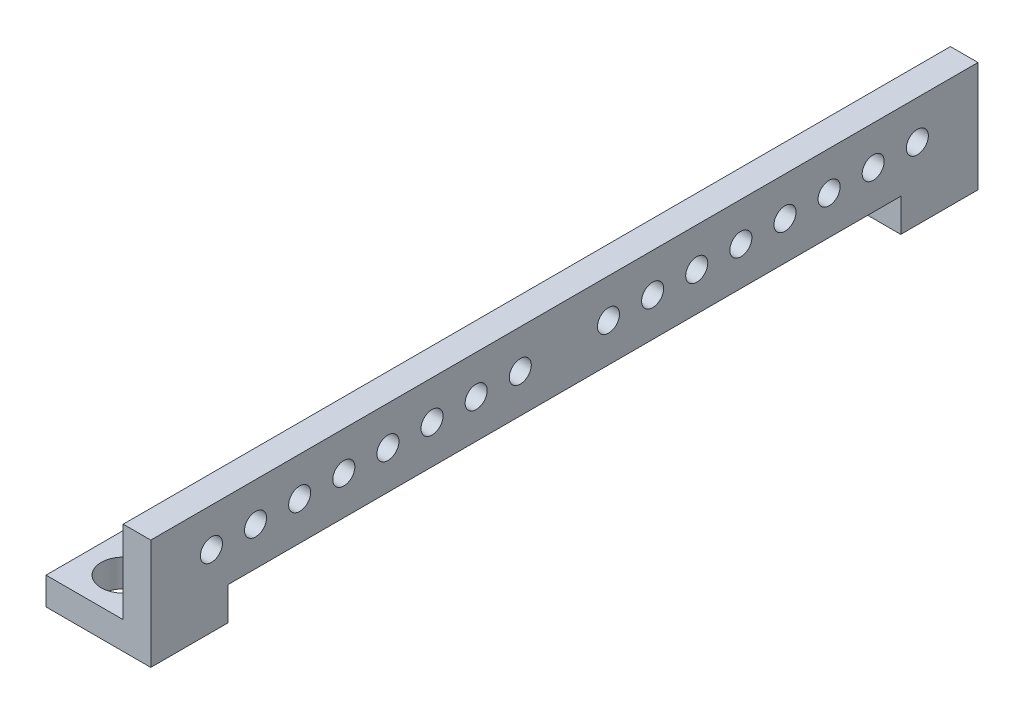
ISO-10303-21;
HEADER;
FILE_DESCRIPTION(('STEP AP214'),'2;1');
FILE_NAME('part.step','',(''),(''),'','','');
FILE_SCHEMA(('AUTOMOTIVE_DESIGN { 1 0 10303 214 1 1 1 1 }'));
ENDSEC;
DATA;
#1=APPLICATION_CONTEXT('core data for automotive mechanical design processes');
#2=APPLICATION_PROTOCOL_DEFINITION('international standard','automotive_design',2000,#1);
#3=PRODUCT_CONTEXT('',#1,'mechanical');
#4=PRODUCT('Part','Part','',(#3));
#5=PRODUCT_RELATED_PRODUCT_CATEGORY('part','',(#4));
#6=PRODUCT_DEFINITION_FORMATION('','',#4);
#7=PRODUCT_DEFINITION_CONTEXT('part definition',#1,'design');
#8=PRODUCT_DEFINITION('design','',#6,#7);
#9=PRODUCT_DEFINITION_SHAPE('','',#8);
#10=(LENGTH_UNIT() NAMED_UNIT(*) SI_UNIT(.MILLI.,.METRE.));
#11=(NAMED_UNIT(*) PLANE_ANGLE_UNIT() SI_UNIT($,.RADIAN.));
#12=(NAMED_UNIT(*) SI_UNIT($,.STERADIAN.) SOLID_ANGLE_UNIT());
#13=UNCERTAINTY_MEASURE_WITH_UNIT(LENGTH_MEASURE(1.E-05),#10,'distance_accuracy_value','');
#14=(GEOMETRIC_REPRESENTATION_CONTEXT(3) GLOBAL_UNCERTAINTY_ASSIGNED_CONTEXT((#13)) GLOBAL_UNIT_ASSIGNED_CONTEXT((#10,
#11,#12)) REPRESENTATION_CONTEXT('',''));
#15=CARTESIAN_POINT('',(0.,0.,0.));
#16=DIRECTION('',(0.,0.,1.));
#17=DIRECTION('',(1.,0.,0.));
#18=AXIS2_PLACEMENT_3D('',#15,#16,#17);
#19=CARTESIAN_POINT('',(0.,0.,0.));
#20=DIRECTION('',(-1.,0.,0.));
#21=DIRECTION('',(0.,0.,1.));
#22=AXIS2_PLACEMENT_3D('',#19,#20,#21);
#23=PLANE('',#22);
#24=CARTESIAN_POINT('',(0.,13.,8.));
#25=DIRECTION('',(1.,0.,0.));
#26=DIRECTION('',(0.,0.,-1.));
#27=AXIS2_PLACEMENT_3D('',#24,#25,#26);
#28=CIRCLE('',#27,2.);
#29=CARTESIAN_POINT('',(0.,13.,6.));
#30=VERTEX_POINT('',#29);
#31=EDGE_CURVE('E208',#30,#30,#28,.T.);
#32=ORIENTED_EDGE('',*,*,#31,.T.);
#33=EDGE_LOOP('',(#32));
#34=FACE_BOUND('',#33,.T.);
#35=CARTESIAN_POINT('',(0.,13.,-56.));
#36=DIRECTION('',(1.,0.,0.));
#37=DIRECTION('',(0.,0.,-1.));
#38=AXIS2_PLACEMENT_3D('',#35,#36,#37);
#39=CIRCLE('',#38,2.);
#40=CARTESIAN_POINT('',(0.,13.,-58.));
#41=VERTEX_POINT('',#40);
#42=EDGE_CURVE('E224',#41,#41,#39,.T.);
#43=ORIENTED_EDGE('',*,*,#42,.T.);
#44=EDGE_LOOP('',(#43));
#45=FACE_BOUND('',#44,.T.);
#46=CARTESIAN_POINT('',(0.,13.,64.));
#47=DIRECTION('',(1.,0.,0.));
#48=DIRECTION('',(0.,0.,-1.));
#49=AXIS2_PLACEMENT_3D('',#46,#47,#48);
#50=CIRCLE('',#49,2.);
#51=CARTESIAN_POINT('',(0.,13.,62.));
#52=VERTEX_POINT('',#51);
#53=EDGE_CURVE('E240',#52,#52,#50,.T.);
#54=ORIENTED_EDGE('',*,*,#53,.T.);
#55=EDGE_LOOP('',(#54));
#56=FACE_BOUND('',#55,.T.);
#57=CARTESIAN_POINT('',(0.,13.,48.));
#58=DIRECTION('',(1.,0.,0.));
#59=DIRECTION('',(0.,0.,-1.));
#60=AXIS2_PLACEMENT_3D('',#57,#58,#59);
#61=CIRCLE('',#60,2.);
#62=CARTESIAN_POINT('',(0.,13.,46.));
#63=VERTEX_POINT('',#62);
#64=EDGE_CURVE('E256',#63,#63,#61,.T.);
#65=ORIENTED_EDGE('',*,*,#64,.T.);
#66=EDGE_LOOP('',(#65));
#67=FACE_BOUND('',#66,.T.);
#68=CARTESIAN_POINT('',(0.,13.,-32.));
#69=DIRECTION('',(1.,0.,0.));
#70=DIRECTION('',(0.,0.,-1.));
#71=AXIS2_PLACEMENT_3D('',#68,#69,#70);
#72=CIRCLE('',#71,2.);
#73=CARTESIAN_POINT('',(0.,13.,-34.));
#74=VERTEX_POINT('',#73);
#75=EDGE_CURVE('E272',#74,#74,#72,.T.);
#76=ORIENTED_EDGE('',*,*,#75,.T.);
#77=EDGE_LOOP('',(#76));
#78=FACE_BOUND('',#77,.T.);
#79=CARTESIAN_POINT('',(0.,13.,-16.));
#80=DIRECTION('',(1.,0.,0.));
#81=DIRECTION('',(0.,0.,-1.));
#82=AXIS2_PLACEMENT_3D('',#79,#80,#81);
#83=CIRCLE('',#82,2.);
#84=CARTESIAN_POINT('',(0.,13.,-18.));
#85=VERTEX_POINT('',#84);
#86=EDGE_CURVE('E288',#85,#85,#83,.T.);
#87=ORIENTED_EDGE('',*,*,#86,.T.);
#88=EDGE_LOOP('',(#87));
#89=FACE_BOUND('',#88,.T.);
#90=CARTESIAN_POINT('',(0.,13.,32.));
#91=DIRECTION('',(1.,0.,0.));
#92=DIRECTION('',(0.,0.,-1.));
#93=AXIS2_PLACEMENT_3D('',#90,#91,#92);
#94=CIRCLE('',#93,2.);
#95=CARTESIAN_POINT('',(0.,13.,30.));
#96=VERTEX_POINT('',#95);
#97=EDGE_CURVE('E304',#96,#96,#94,.T.);
#98=ORIENTED_EDGE('',*,*,#97,.T.);
#99=EDGE_LOOP('',(#98));
#100=FACE_BOUND('',#99,.T.);
#101=CARTESIAN_POINT('',(0.,13.,16.));
#102=DIRECTION('',(1.,0.,0.));
#103=DIRECTION('',(0.,0.,-1.));
#104=AXIS2_PLACEMENT_3D('',#101,#102,#103);
#105=CIRCLE('',#104,2.);
#106=CARTESIAN_POINT('',(0.,13.,14.));
#107=VERTEX_POINT('',#106);
#108=EDGE_CURVE('E320',#107,#107,#105,.T.);
#109=ORIENTED_EDGE('',*,*,#108,.T.);
#110=EDGE_LOOP('',(#109));
#111=FACE_BOUND('',#110,.T.);
#112=CARTESIAN_POINT('',(0.,13.,24.));
#113=DIRECTION('',(1.,0.,0.));
#114=DIRECTION('',(0.,0.,-1.));
#115=AXIS2_PLACEMENT_3D('',#112,#113,#114);
#116=CIRCLE('',#115,2.);
#117=CARTESIAN_POINT('',(0.,13.,22.));
#118=VERTEX_POINT('',#117);
#119=EDGE_CURVE('E312',#118,#118,#116,.T.);
#120=ORIENTED_EDGE('',*,*,#119,.T.);
#121=EDGE_LOOP('',(#120));
#122=FACE_BOUND('',#121,.T.);
#123=CARTESIAN_POINT('',(0.,13.,40.));
#124=DIRECTION('',(1.,0.,0.));
#125=DIRECTION('',(0.,0.,-1.));
#126=AXIS2_PLACEMENT_3D('',#123,#124,#125);
#127=CIRCLE('',#126,2.);
#128=CARTESIAN_POINT('',(0.,13.,38.));
#129=VERTEX_POINT('',#128);
#130=EDGE_CURVE('E296',#129,#129,#127,.T.);
#131=ORIENTED_EDGE('',*,*,#130,.T.);
#132=EDGE_LOOP('',(#131));
#133=FACE_BOUND('',#132,.T.);
#134=CARTESIAN_POINT('',(0.,13.,-24.));
#135=DIRECTION('',(1.,0.,0.));
#136=DIRECTION('',(0.,0.,-1.));
#137=AXIS2_PLACEMENT_3D('',#134,#135,#136);
#138=CIRCLE('',#137,2.);
#139=CARTESIAN_POINT('',(0.,13.,-26.));
#140=VERTEX_POINT('',#139);
#141=EDGE_CURVE('E280',#140,#140,#138,.T.);
#142=ORIENTED_EDGE('',*,*,#141,.T.);
#143=EDGE_LOOP('',(#142));
#144=FACE_BOUND('',#143,.T.);
#145=CARTESIAN_POINT('',(0.,13.,-40.));
#146=DIRECTION('',(1.,0.,0.));
#147=DIRECTION('',(0.,0.,-1.));
#148=AXIS2_PLACEMENT_3D('',#145,#146,#147);
#149=CIRCLE('',#148,2.);
#150=CARTESIAN_POINT('',(0.,13.,-42.));
#151=VERTEX_POINT('',#150);
#152=EDGE_CURVE('E264',#151,#151,#149,.T.);
#153=ORIENTED_EDGE('',*,*,#152,.T.);
#154=EDGE_LOOP('',(#153));
#155=FACE_BOUND('',#154,.T.);
#156=CARTESIAN_POINT('',(0.,13.,56.));
#157=DIRECTION('',(1.,0.,0.));
#158=DIRECTION('',(0.,0.,-1.));
#159=AXIS2_PLACEMENT_3D('',#156,#157,#158);
#160=CIRCLE('',#159,2.);
#161=CARTESIAN_POINT('',(0.,13.,54.));
#162=VERTEX_POINT('',#161);
#163=EDGE_CURVE('E248',#162,#162,#160,.T.);
#164=ORIENTED_EDGE('',*,*,#163,.T.);
#165=EDGE_LOOP('',(#164));
#166=FACE_BOUND('',#165,.T.);
#167=CARTESIAN_POINT('',(0.,13.,-48.));
#168=DIRECTION('',(1.,0.,0.));
#169=DIRECTION('',(0.,0.,-1.));
#170=AXIS2_PLACEMENT_3D('',#167,#168,#169);
#171=CIRCLE('',#170,2.);
#172=CARTESIAN_POINT('',(0.,13.,-50.));
#173=VERTEX_POINT('',#172);
#174=EDGE_CURVE('E232',#173,#173,#171,.T.);
#175=ORIENTED_EDGE('',*,*,#174,.T.);
#176=EDGE_LOOP('',(#175));
#177=FACE_BOUND('',#176,.T.);
#178=CARTESIAN_POINT('',(0.,13.,-64.));
#179=DIRECTION('',(1.,0.,0.));
#180=DIRECTION('',(0.,0.,-1.));
#181=AXIS2_PLACEMENT_3D('',#178,#179,#180);
#182=CIRCLE('',#181,2.);
#183=CARTESIAN_POINT('',(0.,13.,-66.));
#184=VERTEX_POINT('',#183);
#185=EDGE_CURVE('E216',#184,#184,#182,.T.);
#186=ORIENTED_EDGE('',*,*,#185,.T.);
#187=EDGE_LOOP('',(#186));
#188=FACE_BOUND('',#187,.T.);
#189=CARTESIAN_POINT('',(0.,13.,-8.));
#190=DIRECTION('',(1.,0.,0.));
#191=DIRECTION('',(0.,0.,-1.));
#192=AXIS2_PLACEMENT_3D('',#189,#190,#191);
#193=CIRCLE('',#192,2.);
#194=CARTESIAN_POINT('',(0.,13.,-10.));
#195=VERTEX_POINT('',#194);
#196=EDGE_CURVE('E203',#195,#195,#193,.T.);
#197=ORIENTED_EDGE('',*,*,#196,.T.);
#198=EDGE_LOOP('',(#197));
#199=FACE_BOUND('',#198,.T.);
#200=DIRECTION('',(0.,1.,0.));
#201=VECTOR('',#200,1.);
#202=CARTESIAN_POINT('',(0.,0.,61.));
#203=LINE('',#202,#201);
#204=CARTESIAN_POINT('',(0.,5.,61.));
#205=VERTEX_POINT('',#204);
#206=CARTESIAN_POINT('',(0.,6.,61.));
#207=VERTEX_POINT('',#206);
#208=EDGE_CURVE('E367',#205,#207,#203,.T.);
#209=ORIENTED_EDGE('',*,*,#208,.F.);
#210=DIRECTION('',(0.,0.,-1.));
#211=VECTOR('',#210,1.);
#212=CARTESIAN_POINT('',(0.,5.,61.));
#213=LINE('',#212,#211);
#214=CARTESIAN_POINT('',(0.,5.,75.));
#215=VERTEX_POINT('',#214);
#216=EDGE_CURVE('E162',#215,#205,#213,.T.);
#217=ORIENTED_EDGE('',*,*,#216,.F.);
#218=DIRECTION('',(0.,-1.,0.));
#219=VECTOR('',#218,1.);
#220=CARTESIAN_POINT('',(0.,0.,75.));
#221=LINE('',#220,#219);
#222=CARTESIAN_POINT('',(0.,20.,75.));
#223=VERTEX_POINT('',#222);
#224=EDGE_CURVE('E363',#223,#215,#221,.T.);
#225=ORIENTED_EDGE('',*,*,#224,.F.);
#226=DIRECTION('',(0.,0.,1.));
#227=VECTOR('',#226,1.);
#228=CARTESIAN_POINT('',(0.,20.,75.));
#229=LINE('',#228,#227);
#230=CARTESIAN_POINT('',(0.,20.,-75.));
#231=VERTEX_POINT('',#230);
#232=EDGE_CURVE('E360',#231,#223,#229,.T.);
#233=ORIENTED_EDGE('',*,*,#232,.F.);
#234=DIRECTION('',(0.,1.,0.));
#235=VECTOR('',#234,1.);
#236=CARTESIAN_POINT('',(0.,0.,-75.));
#237=LINE('',#236,#235);
#238=CARTESIAN_POINT('',(0.,5.,-75.));
#239=VERTEX_POINT('',#238);
#240=EDGE_CURVE('E328',#239,#231,#237,.T.);
#241=ORIENTED_EDGE('',*,*,#240,.F.);
#242=DIRECTION('',(0.,0.,-1.));
#243=VECTOR('',#242,1.);
#244=CARTESIAN_POINT('',(0.,5.,-75.));
#245=LINE('',#244,#243);
#246=CARTESIAN_POINT('',(0.,5.,-61.));
#247=VERTEX_POINT('',#246);
#248=EDGE_CURVE('E69',#247,#239,#245,.T.);
#249=ORIENTED_EDGE('',*,*,#248,.F.);
#250=DIRECTION('',(0.,-1.,0.));
#251=VECTOR('',#250,1.);
#252=CARTESIAN_POINT('',(0.,0.,-61.));
#253=LINE('',#252,#251);
#254=CARTESIAN_POINT('',(0.,6.,-61.));
#255=VERTEX_POINT('',#254);
#256=EDGE_CURVE('E337',#255,#247,#253,.T.);
#257=ORIENTED_EDGE('',*,*,#256,.F.);
#258=DIRECTION('',(0.,0.,-1.));
#259=VECTOR('',#258,1.);
#260=CARTESIAN_POINT('',(0.,6.,61.));
#261=LINE('',#260,#259);
#262=EDGE_CURVE('E370',#207,#255,#261,.T.);
#263=ORIENTED_EDGE('',*,*,#262,.F.);
#264=EDGE_LOOP('',(#209,#217,#225,#233,#241,#249,#257,#263));
#265=FACE_BOUND('',#264,.T.);
#266=ADVANCED_FACE('F43',(#34,#45,#56,#67,#78,#89,#100,#111,#122,#133,#144,#155,#166,#177,#188,
#199,#265),#23,.T.);
#267=CARTESIAN_POINT('',(5.,0.,0.));
#268=DIRECTION('',(-1.,0.,0.));
#269=DIRECTION('',(0.,0.,1.));
#270=AXIS2_PLACEMENT_3D('',#267,#268,#269);
#271=PLANE('',#270);
#272=DIRECTION('',(0.,1.,0.));
#273=VECTOR('',#272,1.);
#274=CARTESIAN_POINT('',(5.,0.,-75.));
#275=LINE('',#274,#273);
#276=CARTESIAN_POINT('',(5.,0.,-75.));
#277=VERTEX_POINT('',#276);
#278=CARTESIAN_POINT('',(5.,20.,-75.));
#279=VERTEX_POINT('',#278);
#280=EDGE_CURVE('E332',#277,#279,#275,.T.);
#281=ORIENTED_EDGE('',*,*,#280,.T.);
#282=DIRECTION('',(0.,0.,1.));
#283=VECTOR('',#282,1.);
#284=CARTESIAN_POINT('',(5.,20.,75.));
#285=LINE('',#284,#283);
#286=CARTESIAN_POINT('',(5.,20.,75.));
#287=VERTEX_POINT('',#286);
#288=EDGE_CURVE('E336',#279,#287,#285,.T.);
#289=ORIENTED_EDGE('',*,*,#288,.T.);
#290=DIRECTION('',(0.,-1.,0.));
#291=VECTOR('',#290,1.);
#292=CARTESIAN_POINT('',(5.,0.,75.));
#293=LINE('',#292,#291);
#294=CARTESIAN_POINT('',(5.,0.,75.));
#295=VERTEX_POINT('',#294);
#296=EDGE_CURVE('E340',#287,#295,#293,.T.);
#297=ORIENTED_EDGE('',*,*,#296,.T.);
#298=DIRECTION('',(0.,0.,-1.));
#299=VECTOR('',#298,1.);
#300=CARTESIAN_POINT('',(5.,0.,75.));
#301=LINE('',#300,#299);
#302=CARTESIAN_POINT('',(5.,0.,61.));
#303=VERTEX_POINT('',#302);
#304=EDGE_CURVE('E343',#295,#303,#301,.T.);
#305=ORIENTED_EDGE('',*,*,#304,.T.);
#306=DIRECTION('',(0.,1.,0.));
#307=VECTOR('',#306,1.);
#308=CARTESIAN_POINT('',(5.,0.,61.));
#309=LINE('',#308,#307);
#310=CARTESIAN_POINT('',(5.,6.,61.));
#311=VERTEX_POINT('',#310);
#312=EDGE_CURVE('E142',#303,#311,#309,.T.);
#313=ORIENTED_EDGE('',*,*,#312,.T.);
#314=DIRECTION('',(0.,0.,-1.));
#315=VECTOR('',#314,1.);
#316=CARTESIAN_POINT('',(5.,6.,61.));
#317=LINE('',#316,#315);
#318=CARTESIAN_POINT('',(5.,6.,-61.));
#319=VERTEX_POINT('',#318);
#320=EDGE_CURVE('E348',#311,#319,#317,.T.);
#321=ORIENTED_EDGE('',*,*,#320,.T.);
#322=DIRECTION('',(0.,-1.,0.));
#323=VECTOR('',#322,1.);
#324=CARTESIAN_POINT('',(5.,0.,-61.));
#325=LINE('',#324,#323);
#326=CARTESIAN_POINT('',(5.,0.,-61.));
#327=VERTEX_POINT('',#326);
#328=EDGE_CURVE('E351',#319,#327,#325,.T.);
#329=ORIENTED_EDGE('',*,*,#328,.T.);
#330=DIRECTION('',(0.,0.,-1.));
#331=VECTOR('',#330,1.);
#332=CARTESIAN_POINT('',(5.,0.,-61.));
#333=LINE('',#332,#331);
#334=EDGE_CURVE('E354',#327,#277,#333,.T.);
#335=ORIENTED_EDGE('',*,*,#334,.T.);
#336=EDGE_LOOP('',(#281,#289,#297,#305,#313,#321,#329,#335));
#337=FACE_BOUND('',#336,.T.);
#338=CARTESIAN_POINT('',(5.,13.,16.));
#339=DIRECTION('',(1.,0.,0.));
#340=DIRECTION('',(0.,0.,-1.));
#341=AXIS2_PLACEMENT_3D('',#338,#339,#340);
#342=CIRCLE('',#341,2.);
#343=CARTESIAN_POINT('',(5.,13.,14.));
#344=VERTEX_POINT('',#343);
#345=EDGE_CURVE('E324',#344,#344,#342,.T.);
#346=ORIENTED_EDGE('',*,*,#345,.F.);
#347=EDGE_LOOP('',(#346));
#348=FACE_BOUND('',#347,.T.);
#349=CARTESIAN_POINT('',(5.,13.,24.));
#350=DIRECTION('',(1.,0.,0.));
#351=DIRECTION('',(0.,0.,-1.));
#352=AXIS2_PLACEMENT_3D('',#349,#350,#351);
#353=CIRCLE('',#352,2.);
#354=CARTESIAN_POINT('',(5.,13.,22.));
#355=VERTEX_POINT('',#354);
#356=EDGE_CURVE('E316',#355,#355,#353,.T.);
#357=ORIENTED_EDGE('',*,*,#356,.F.);
#358=EDGE_LOOP('',(#357));
#359=FACE_BOUND('',#358,.T.);
#360=CARTESIAN_POINT('',(5.,13.,32.));
#361=DIRECTION('',(1.,0.,0.));
#362=DIRECTION('',(0.,0.,-1.));
#363=AXIS2_PLACEMENT_3D('',#360,#361,#362);
#364=CIRCLE('',#363,2.);
#365=CARTESIAN_POINT('',(5.,13.,30.));
#366=VERTEX_POINT('',#365);
#367=EDGE_CURVE('E308',#366,#366,#364,.T.);
#368=ORIENTED_EDGE('',*,*,#367,.F.);
#369=EDGE_LOOP('',(#368));
#370=FACE_BOUND('',#369,.T.);
#371=CARTESIAN_POINT('',(5.,13.,40.));
#372=DIRECTION('',(1.,0.,0.));
#373=DIRECTION('',(0.,0.,-1.));
#374=AXIS2_PLACEMENT_3D('',#371,#372,#373);
#375=CIRCLE('',#374,2.);
#376=CARTESIAN_POINT('',(5.,13.,38.));
#377=VERTEX_POINT('',#376);
#378=EDGE_CURVE('E300',#377,#377,#375,.T.);
#379=ORIENTED_EDGE('',*,*,#378,.F.);
#380=EDGE_LOOP('',(#379));
#381=FACE_BOUND('',#380,.T.);
#382=CARTESIAN_POINT('',(5.,13.,-16.));
#383=DIRECTION('',(1.,0.,0.));
#384=DIRECTION('',(0.,0.,-1.));
#385=AXIS2_PLACEMENT_3D('',#382,#383,#384);
#386=CIRCLE('',#385,2.);
#387=CARTESIAN_POINT('',(5.,13.,-18.));
#388=VERTEX_POINT('',#387);
#389=EDGE_CURVE('E292',#388,#388,#386,.T.);
#390=ORIENTED_EDGE('',*,*,#389,.F.);
#391=EDGE_LOOP('',(#390));
#392=FACE_BOUND('',#391,.T.);
#393=CARTESIAN_POINT('',(5.,13.,-24.));
#394=DIRECTION('',(1.,0.,0.));
#395=DIRECTION('',(0.,0.,-1.));
#396=AXIS2_PLACEMENT_3D('',#393,#394,#395);
#397=CIRCLE('',#396,2.);
#398=CARTESIAN_POINT('',(5.,13.,-26.));
#399=VERTEX_POINT('',#398);
#400=EDGE_CURVE('E284',#399,#399,#397,.T.);
#401=ORIENTED_EDGE('',*,*,#400,.F.);
#402=EDGE_LOOP('',(#401));
#403=FACE_BOUND('',#402,.T.);
#404=CARTESIAN_POINT('',(5.,13.,-32.));
#405=DIRECTION('',(1.,0.,0.));
#406=DIRECTION('',(0.,0.,-1.));
#407=AXIS2_PLACEMENT_3D('',#404,#405,#406);
#408=CIRCLE('',#407,2.);
#409=CARTESIAN_POINT('',(5.,13.,-34.));
#410=VERTEX_POINT('',#409);
#411=EDGE_CURVE('E276',#410,#410,#408,.T.);
#412=ORIENTED_EDGE('',*,*,#411,.F.);
#413=EDGE_LOOP('',(#412));
#414=FACE_BOUND('',#413,.T.);
#415=CARTESIAN_POINT('',(5.,13.,-40.));
#416=DIRECTION('',(1.,0.,0.));
#417=DIRECTION('',(0.,0.,-1.));
#418=AXIS2_PLACEMENT_3D('',#415,#416,#417);
#419=CIRCLE('',#418,2.);
#420=CARTESIAN_POINT('',(5.,13.,-42.));
#421=VERTEX_POINT('',#420);
#422=EDGE_CURVE('E268',#421,#421,#419,.T.);
#423=ORIENTED_EDGE('',*,*,#422,.F.);
#424=EDGE_LOOP('',(#423));
#425=FACE_BOUND('',#424,.T.);
#426=CARTESIAN_POINT('',(5.,13.,48.));
#427=DIRECTION('',(1.,0.,0.));
#428=DIRECTION('',(0.,0.,-1.));
#429=AXIS2_PLACEMENT_3D('',#426,#427,#428);
#430=CIRCLE('',#429,2.);
#431=CARTESIAN_POINT('',(5.,13.,46.));
#432=VERTEX_POINT('',#431);
#433=EDGE_CURVE('E260',#432,#432,#430,.T.);
#434=ORIENTED_EDGE('',*,*,#433,.F.);
#435=EDGE_LOOP('',(#434));
#436=FACE_BOUND('',#435,.T.);
#437=CARTESIAN_POINT('',(5.,13.,56.));
#438=DIRECTION('',(1.,0.,0.));
#439=DIRECTION('',(0.,0.,-1.));
#440=AXIS2_PLACEMENT_3D('',#437,#438,#439);
#441=CIRCLE('',#440,2.);
#442=CARTESIAN_POINT('',(5.,13.,54.));
#443=VERTEX_POINT('',#442);
#444=EDGE_CURVE('E252',#443,#443,#441,.T.);
#445=ORIENTED_EDGE('',*,*,#444,.F.);
#446=EDGE_LOOP('',(#445));
#447=FACE_BOUND('',#446,.T.);
#448=CARTESIAN_POINT('',(5.,13.,64.));
#449=DIRECTION('',(1.,0.,0.));
#450=DIRECTION('',(0.,0.,-1.));
#451=AXIS2_PLACEMENT_3D('',#448,#449,#450);
#452=CIRCLE('',#451,2.);
#453=CARTESIAN_POINT('',(5.,13.,62.));
#454=VERTEX_POINT('',#453);
#455=EDGE_CURVE('E244',#454,#454,#452,.T.);
#456=ORIENTED_EDGE('',*,*,#455,.F.);
#457=EDGE_LOOP('',(#456));
#458=FACE_BOUND('',#457,.T.);
#459=CARTESIAN_POINT('',(5.,13.,-48.));
#460=DIRECTION('',(1.,0.,0.));
#461=DIRECTION('',(0.,0.,-1.));
#462=AXIS2_PLACEMENT_3D('',#459,#460,#461);
#463=CIRCLE('',#462,2.);
#464=CARTESIAN_POINT('',(5.,13.,-50.));
#465=VERTEX_POINT('',#464);
#466=EDGE_CURVE('E236',#465,#465,#463,.T.);
#467=ORIENTED_EDGE('',*,*,#466,.F.);
#468=EDGE_LOOP('',(#467));
#469=FACE_BOUND('',#468,.T.);
#470=CARTESIAN_POINT('',(5.,13.,-56.));
#471=DIRECTION('',(1.,0.,0.));
#472=DIRECTION('',(0.,0.,-1.));
#473=AXIS2_PLACEMENT_3D('',#470,#471,#472);
#474=CIRCLE('',#473,2.);
#475=CARTESIAN_POINT('',(5.,13.,-58.));
#476=VERTEX_POINT('',#475);
#477=EDGE_CURVE('E228',#476,#476,#474,.T.);
#478=ORIENTED_EDGE('',*,*,#477,.F.);
#479=EDGE_LOOP('',(#478));
#480=FACE_BOUND('',#479,.T.);
#481=CARTESIAN_POINT('',(5.,13.,-64.));
#482=DIRECTION('',(1.,0.,0.));
#483=DIRECTION('',(0.,0.,-1.));
#484=AXIS2_PLACEMENT_3D('',#481,#482,#483);
#485=CIRCLE('',#484,2.);
#486=CARTESIAN_POINT('',(5.,13.,-66.));
#487=VERTEX_POINT('',#486);
#488=EDGE_CURVE('E220',#487,#487,#485,.T.);
#489=ORIENTED_EDGE('',*,*,#488,.F.);
#490=EDGE_LOOP('',(#489));
#491=FACE_BOUND('',#490,.T.);
#492=CARTESIAN_POINT('',(5.,13.,8.));
#493=DIRECTION('',(1.,0.,0.));
#494=DIRECTION('',(0.,0.,-1.));
#495=AXIS2_PLACEMENT_3D('',#492,#493,#494);
#496=CIRCLE('',#495,2.);
#497=CARTESIAN_POINT('',(5.,13.,6.));
#498=VERTEX_POINT('',#497);
#499=EDGE_CURVE('E212',#498,#498,#496,.T.);
#500=ORIENTED_EDGE('',*,*,#499,.F.);
#501=EDGE_LOOP('',(#500));
#502=FACE_BOUND('',#501,.T.);
#503=CARTESIAN_POINT('',(5.,13.,-8.));
#504=DIRECTION('',(1.,0.,0.));
#505=DIRECTION('',(0.,0.,-1.));
#506=AXIS2_PLACEMENT_3D('',#503,#504,#505);
#507=CIRCLE('',#506,2.);
#508=CARTESIAN_POINT('',(5.,13.,-10.));
#509=VERTEX_POINT('',#508);
#510=EDGE_CURVE('E204',#509,#509,#507,.T.);
#511=ORIENTED_EDGE('',*,*,#510,.F.);
#512=EDGE_LOOP('',(#511));
#513=FACE_BOUND('',#512,.T.);
#514=ADVANCED_FACE('F435',(#337,#348,#359,#370,#381,#392,#403,#414,#425,#436,#447,#458,#469,
#480,#491,#502,#513),#271,.F.);
#515=CARTESIAN_POINT('',(5.,0.,-75.));
#516=DIRECTION('',(0.,0.,1.));
#517=DIRECTION('',(0.,-1.,0.));
#518=AXIS2_PLACEMENT_3D('',#515,#516,#517);
#519=PLANE('',#518);
#520=DIRECTION('',(-1.,0.,0.));
#521=VECTOR('',#520,1.);
#522=CARTESIAN_POINT('',(5.,0.,-75.));
#523=LINE('',#522,#521);
#524=CARTESIAN_POINT('',(-14.,0.,-75.));
#525=VERTEX_POINT('',#524);
#526=EDGE_CURVE('E357',#277,#525,#523,.T.);
#527=ORIENTED_EDGE('',*,*,#526,.T.);
#528=DIRECTION('',(0.,-1.,0.));
#529=VECTOR('',#528,1.);
#530=CARTESIAN_POINT('',(-14.,0.,-75.));
#531=LINE('',#530,#529);
#532=CARTESIAN_POINT('',(-14.,5.,-75.));
#533=VERTEX_POINT('',#532);
#534=EDGE_CURVE('E179',#533,#525,#531,.T.);
#535=ORIENTED_EDGE('',*,*,#534,.F.);
#536=DIRECTION('',(1.,0.,0.));
#537=VECTOR('',#536,1.);
#538=CARTESIAN_POINT('',(-14.,5.,-75.));
#539=LINE('',#538,#537);
#540=EDGE_CURVE('E193',#533,#239,#539,.T.);
#541=ORIENTED_EDGE('',*,*,#540,.T.);
#542=ORIENTED_EDGE('',*,*,#240,.T.);
#543=DIRECTION('',(-1.,0.,0.));
#544=VECTOR('',#543,1.);
#545=CARTESIAN_POINT('',(5.,20.,-75.));
#546=LINE('',#545,#544);
#547=EDGE_CURVE('E11',#279,#231,#546,.T.);
#548=ORIENTED_EDGE('',*,*,#547,.F.);
#549=ORIENTED_EDGE('',*,*,#280,.F.);
#550=EDGE_LOOP('',(#527,#535,#541,#542,#548,#549));
#551=FACE_BOUND('',#550,.T.);
#552=ADVANCED_FACE('F45',(#551),#519,.F.);
#553=CARTESIAN_POINT('',(5.,20.,75.));
#554=DIRECTION('',(0.,-1.,0.));
#555=DIRECTION('',(0.,0.,-1.));
#556=AXIS2_PLACEMENT_3D('',#553,#554,#555);
#557=PLANE('',#556);
#558=ORIENTED_EDGE('',*,*,#232,.T.);
#559=DIRECTION('',(-1.,0.,0.));
#560=VECTOR('',#559,1.);
#561=CARTESIAN_POINT('',(5.,20.,75.));
#562=LINE('',#561,#560);
#563=EDGE_CURVE('E53',#287,#223,#562,.T.);
#564=ORIENTED_EDGE('',*,*,#563,.F.);
#565=ORIENTED_EDGE('',*,*,#288,.F.);
#566=ORIENTED_EDGE('',*,*,#547,.T.);
#567=EDGE_LOOP('',(#558,#564,#565,#566));
#568=FACE_BOUND('',#567,.T.);
#569=ADVANCED_FACE('F618',(#568),#557,.F.);
#570=CARTESIAN_POINT('',(5.,0.,75.));
#571=DIRECTION('',(0.,0.,-1.));
#572=DIRECTION('',(-1.,0.,0.));
#573=AXIS2_PLACEMENT_3D('',#570,#571,#572);
#574=PLANE('',#573);
#575=ORIENTED_EDGE('',*,*,#224,.T.);
#576=DIRECTION('',(1.,0.,0.));
#577=VECTOR('',#576,1.);
#578=CARTESIAN_POINT('',(-14.,5.,75.));
#579=LINE('',#578,#577);
#580=CARTESIAN_POINT('',(-14.,5.,75.));
#581=VERTEX_POINT('',#580);
#582=EDGE_CURVE('E176',#581,#215,#579,.T.);
#583=ORIENTED_EDGE('',*,*,#582,.F.);
#584=DIRECTION('',(0.,1.,0.));
#585=VECTOR('',#584,1.);
#586=CARTESIAN_POINT('',(-14.,0.,75.));
#587=LINE('',#586,#585);
#588=CARTESIAN_POINT('',(-14.,0.,75.));
#589=VERTEX_POINT('',#588);
#590=EDGE_CURVE('E156',#589,#581,#587,.T.);
#591=ORIENTED_EDGE('',*,*,#590,.F.);
#592=DIRECTION('',(-1.,0.,0.));
#593=VECTOR('',#592,1.);
#594=CARTESIAN_POINT('',(5.,0.,75.));
#595=LINE('',#594,#593);
#596=EDGE_CURVE('E146',#295,#589,#595,.T.);
#597=ORIENTED_EDGE('',*,*,#596,.F.);
#598=ORIENTED_EDGE('',*,*,#296,.F.);
#599=ORIENTED_EDGE('',*,*,#563,.T.);
#600=EDGE_LOOP('',(#575,#583,#591,#597,#598,#599));
#601=FACE_BOUND('',#600,.T.);
#602=ADVANCED_FACE('F607',(#601),#574,.F.);
#603=CARTESIAN_POINT('',(5.,0.,75.));
#604=DIRECTION('',(0.,1.,0.));
#605=DIRECTION('',(0.,0.,1.));
#606=AXIS2_PLACEMENT_3D('',#603,#604,#605);
#607=PLANE('',#606);
#608=CARTESIAN_POINT('',(-7.,0.,68.));
#609=DIRECTION('',(0.,-1.,0.));
#610=DIRECTION('',(0.,0.,-1.));
#611=AXIS2_PLACEMENT_3D('',#608,#609,#610);
#612=CIRCLE('',#611,4.);
#613=CARTESIAN_POINT('',(-7.,0.,64.));
#614=VERTEX_POINT('',#613);
#615=EDGE_CURVE('E394',#614,#614,#612,.T.);
#616=ORIENTED_EDGE('',*,*,#615,.F.);
#617=EDGE_LOOP('',(#616));
#618=FACE_BOUND('',#617,.T.);
#619=ORIENTED_EDGE('',*,*,#596,.T.);
#620=DIRECTION('',(0.,0.,1.));
#621=VECTOR('',#620,1.);
#622=CARTESIAN_POINT('',(-14.,0.,61.));
#623=LINE('',#622,#621);
#624=CARTESIAN_POINT('',(-14.,0.,61.));
#625=VERTEX_POINT('',#624);
#626=EDGE_CURVE('E150',#625,#589,#623,.T.);
#627=ORIENTED_EDGE('',*,*,#626,.F.);
#628=DIRECTION('',(-1.,0.,0.));
#629=VECTOR('',#628,1.);
#630=CARTESIAN_POINT('',(5.,0.,61.));
#631=LINE('',#630,#629);
#632=EDGE_CURVE('E136',#303,#625,#631,.T.);
#633=ORIENTED_EDGE('',*,*,#632,.F.);
#634=ORIENTED_EDGE('',*,*,#304,.F.);
#635=EDGE_LOOP('',(#619,#627,#633,#634));
#636=FACE_BOUND('',#635,.T.);
#637=ADVANCED_FACE('F151',(#618,#636),#607,.F.);
#638=CARTESIAN_POINT('',(5.,0.,61.));
#639=DIRECTION('',(0.,0.,1.));
#640=DIRECTION('',(1.,0.,0.));
#641=AXIS2_PLACEMENT_3D('',#638,#639,#640);
#642=PLANE('',#641);
#643=ORIENTED_EDGE('',*,*,#632,.T.);
#644=DIRECTION('',(0.,-1.,0.));
#645=VECTOR('',#644,1.);
#646=CARTESIAN_POINT('',(-14.,0.,61.));
#647=LINE('',#646,#645);
#648=CARTESIAN_POINT('',(-14.,5.,61.));
#649=VERTEX_POINT('',#648);
#650=EDGE_CURVE('E140',#649,#625,#647,.T.);
#651=ORIENTED_EDGE('',*,*,#650,.F.);
#652=DIRECTION('',(1.,0.,0.));
#653=VECTOR('',#652,1.);
#654=CARTESIAN_POINT('',(-14.,5.,61.));
#655=LINE('',#654,#653);
#656=EDGE_CURVE('E61',#649,#205,#655,.T.);
#657=ORIENTED_EDGE('',*,*,#656,.T.);
#658=ORIENTED_EDGE('',*,*,#208,.T.);
#659=DIRECTION('',(-1.,0.,0.));
#660=VECTOR('',#659,1.);
#661=CARTESIAN_POINT('',(5.,6.,61.));
#662=LINE('',#661,#660);
#663=EDGE_CURVE('E147',#311,#207,#662,.T.);
#664=ORIENTED_EDGE('',*,*,#663,.F.);
#665=ORIENTED_EDGE('',*,*,#312,.F.);
#666=EDGE_LOOP('',(#643,#651,#657,#658,#664,#665));
#667=FACE_BOUND('',#666,.T.);
#668=ADVANCED_FACE('F138',(#667),#642,.F.);
#669=CARTESIAN_POINT('',(5.,6.,61.));
#670=DIRECTION('',(0.,1.,0.));
#671=DIRECTION('',(0.,0.,1.));
#672=AXIS2_PLACEMENT_3D('',#669,#670,#671);
#673=PLANE('',#672);
#674=ORIENTED_EDGE('',*,*,#262,.T.);
#675=DIRECTION('',(-1.,0.,0.));
#676=VECTOR('',#675,1.);
#677=CARTESIAN_POINT('',(5.,6.,-61.));
#678=LINE('',#677,#676);
#679=EDGE_CURVE('E380',#319,#255,#678,.T.);
#680=ORIENTED_EDGE('',*,*,#679,.F.);
#681=ORIENTED_EDGE('',*,*,#320,.F.);
#682=ORIENTED_EDGE('',*,*,#663,.T.);
#683=EDGE_LOOP('',(#674,#680,#681,#682));
#684=FACE_BOUND('',#683,.T.);
#685=ADVANCED_FACE('F444',(#684),#673,.F.);
#686=CARTESIAN_POINT('',(5.,0.,-61.));
#687=DIRECTION('',(0.,0.,-1.));
#688=DIRECTION('',(-1.,0.,0.));
#689=AXIS2_PLACEMENT_3D('',#686,#687,#688);
#690=PLANE('',#689);
#691=ORIENTED_EDGE('',*,*,#256,.T.);
#692=DIRECTION('',(1.,0.,0.));
#693=VECTOR('',#692,1.);
#694=CARTESIAN_POINT('',(-14.,5.,-61.));
#695=LINE('',#694,#693);
#696=CARTESIAN_POINT('',(-14.,5.,-61.));
#697=VERTEX_POINT('',#696);
#698=EDGE_CURVE('E199',#697,#247,#695,.T.);
#699=ORIENTED_EDGE('',*,*,#698,.F.);
#700=DIRECTION('',(0.,1.,0.));
#701=VECTOR('',#700,1.);
#702=CARTESIAN_POINT('',(-14.,0.,-61.));
#703=LINE('',#702,#701);
#704=CARTESIAN_POINT('',(-14.,0.,-61.));
#705=VERTEX_POINT('',#704);
#706=EDGE_CURVE('E187',#705,#697,#703,.T.);
#707=ORIENTED_EDGE('',*,*,#706,.F.);
#708=DIRECTION('',(-1.,0.,0.));
#709=VECTOR('',#708,1.);
#710=CARTESIAN_POINT('',(5.,0.,-61.));
#711=LINE('',#710,#709);
#712=EDGE_CURVE('E377',#327,#705,#711,.T.);
#713=ORIENTED_EDGE('',*,*,#712,.F.);
#714=ORIENTED_EDGE('',*,*,#328,.F.);
#715=ORIENTED_EDGE('',*,*,#679,.T.);
#716=EDGE_LOOP('',(#691,#699,#707,#713,#714,#715));
#717=FACE_BOUND('',#716,.T.);
#718=ADVANCED_FACE('F414',(#717),#690,.F.);
#719=CARTESIAN_POINT('',(5.,0.,-61.));
#720=DIRECTION('',(0.,1.,0.));
#721=DIRECTION('',(0.,0.,1.));
#722=AXIS2_PLACEMENT_3D('',#719,#720,#721);
#723=PLANE('',#722);
#724=CARTESIAN_POINT('',(-7.,0.,-68.));
#725=DIRECTION('',(0.,-1.,0.));
#726=DIRECTION('',(0.,0.,-1.));
#727=AXIS2_PLACEMENT_3D('',#724,#725,#726);
#728=CIRCLE('',#727,4.);
#729=CARTESIAN_POINT('',(-7.,0.,-72.));
#730=VERTEX_POINT('',#729);
#731=EDGE_CURVE('E167',#730,#730,#728,.T.);
#732=ORIENTED_EDGE('',*,*,#731,.F.);
#733=EDGE_LOOP('',(#732));
#734=FACE_BOUND('',#733,.T.);
#735=ORIENTED_EDGE('',*,*,#712,.T.);
#736=DIRECTION('',(0.,0.,1.));
#737=VECTOR('',#736,1.);
#738=CARTESIAN_POINT('',(-14.,0.,-75.));
#739=LINE('',#738,#737);
#740=EDGE_CURVE('E183',#525,#705,#739,.T.);
#741=ORIENTED_EDGE('',*,*,#740,.F.);
#742=ORIENTED_EDGE('',*,*,#526,.F.);
#743=ORIENTED_EDGE('',*,*,#334,.F.);
#744=EDGE_LOOP('',(#735,#741,#742,#743));
#745=FACE_BOUND('',#744,.T.);
#746=ADVANCED_FACE('F410',(#734,#745),#723,.F.);
#747=CARTESIAN_POINT('',(5.,13.,16.));
#748=DIRECTION('',(-1.,0.,0.));
#749=DIRECTION('',(0.,0.,1.));
#750=AXIS2_PLACEMENT_3D('',#747,#748,#749);
#751=CYLINDRICAL_SURFACE('',#750,2.);
#752=ORIENTED_EDGE('',*,*,#345,.T.);
#753=EDGE_LOOP('',(#752));
#754=FACE_BOUND('',#753,.T.);
#755=ORIENTED_EDGE('',*,*,#108,.F.);
#756=EDGE_LOOP('',(#755));
#757=FACE_BOUND('',#756,.T.);
#758=ADVANCED_FACE('F413',(#754,#757),#751,.F.);
#759=CARTESIAN_POINT('',(5.,13.,24.));
#760=DIRECTION('',(-1.,0.,0.));
#761=DIRECTION('',(0.,0.,1.));
#762=AXIS2_PLACEMENT_3D('',#759,#760,#761);
#763=CYLINDRICAL_SURFACE('',#762,2.);
#764=ORIENTED_EDGE('',*,*,#356,.T.);
#765=EDGE_LOOP('',(#764));
#766=FACE_BOUND('',#765,.T.);
#767=ORIENTED_EDGE('',*,*,#119,.F.);
#768=EDGE_LOOP('',(#767));
#769=FACE_BOUND('',#768,.T.);
#770=ADVANCED_FACE('F464',(#766,#769),#763,.F.);
#771=CARTESIAN_POINT('',(5.,13.,32.));
#772=DIRECTION('',(-1.,0.,0.));
#773=DIRECTION('',(0.,0.,1.));
#774=AXIS2_PLACEMENT_3D('',#771,#772,#773);
#775=CYLINDRICAL_SURFACE('',#774,2.);
#776=ORIENTED_EDGE('',*,*,#367,.T.);
#777=EDGE_LOOP('',(#776));
#778=FACE_BOUND('',#777,.T.);
#779=ORIENTED_EDGE('',*,*,#97,.F.);
#780=EDGE_LOOP('',(#779));
#781=FACE_BOUND('',#780,.T.);
#782=ADVANCED_FACE('F468',(#778,#781),#775,.F.);
#783=CARTESIAN_POINT('',(5.,13.,40.));
#784=DIRECTION('',(-1.,0.,0.));
#785=DIRECTION('',(0.,0.,1.));
#786=AXIS2_PLACEMENT_3D('',#783,#784,#785);
#787=CYLINDRICAL_SURFACE('',#786,2.);
#788=ORIENTED_EDGE('',*,*,#378,.T.);
#789=EDGE_LOOP('',(#788));
#790=FACE_BOUND('',#789,.T.);
#791=ORIENTED_EDGE('',*,*,#130,.F.);
#792=EDGE_LOOP('',(#791));
#793=FACE_BOUND('',#792,.T.);
#794=ADVANCED_FACE('F472',(#790,#793),#787,.F.);
#795=CARTESIAN_POINT('',(5.,13.,-16.));
#796=DIRECTION('',(-1.,0.,0.));
#797=DIRECTION('',(0.,0.,1.));
#798=AXIS2_PLACEMENT_3D('',#795,#796,#797);
#799=CYLINDRICAL_SURFACE('',#798,2.);
#800=ORIENTED_EDGE('',*,*,#389,.T.);
#801=EDGE_LOOP('',(#800));
#802=FACE_BOUND('',#801,.T.);
#803=ORIENTED_EDGE('',*,*,#86,.F.);
#804=EDGE_LOOP('',(#803));
#805=FACE_BOUND('',#804,.T.);
#806=ADVANCED_FACE('F476',(#802,#805),#799,.F.);
#807=CARTESIAN_POINT('',(5.,13.,-24.));
#808=DIRECTION('',(-1.,0.,0.));
#809=DIRECTION('',(0.,0.,1.));
#810=AXIS2_PLACEMENT_3D('',#807,#808,#809);
#811=CYLINDRICAL_SURFACE('',#810,2.);
#812=ORIENTED_EDGE('',*,*,#400,.T.);
#813=EDGE_LOOP('',(#812));
#814=FACE_BOUND('',#813,.T.);
#815=ORIENTED_EDGE('',*,*,#141,.F.);
#816=EDGE_LOOP('',(#815));
#817=FACE_BOUND('',#816,.T.);
#818=ADVANCED_FACE('F480',(#814,#817),#811,.F.);
#819=CARTESIAN_POINT('',(5.,13.,-32.));
#820=DIRECTION('',(-1.,0.,0.));
#821=DIRECTION('',(0.,0.,1.));
#822=AXIS2_PLACEMENT_3D('',#819,#820,#821);
#823=CYLINDRICAL_SURFACE('',#822,2.);
#824=ORIENTED_EDGE('',*,*,#411,.T.);
#825=EDGE_LOOP('',(#824));
#826=FACE_BOUND('',#825,.T.);
#827=ORIENTED_EDGE('',*,*,#75,.F.);
#828=EDGE_LOOP('',(#827));
#829=FACE_BOUND('',#828,.T.);
#830=ADVANCED_FACE('F484',(#826,#829),#823,.F.);
#831=CARTESIAN_POINT('',(5.,13.,-40.));
#832=DIRECTION('',(-1.,0.,0.));
#833=DIRECTION('',(0.,0.,1.));
#834=AXIS2_PLACEMENT_3D('',#831,#832,#833);
#835=CYLINDRICAL_SURFACE('',#834,2.);
#836=ORIENTED_EDGE('',*,*,#422,.T.);
#837=EDGE_LOOP('',(#836));
#838=FACE_BOUND('',#837,.T.);
#839=ORIENTED_EDGE('',*,*,#152,.F.);
#840=EDGE_LOOP('',(#839));
#841=FACE_BOUND('',#840,.T.);
#842=ADVANCED_FACE('F488',(#838,#841),#835,.F.);
#843=CARTESIAN_POINT('',(5.,13.,48.));
#844=DIRECTION('',(-1.,0.,0.));
#845=DIRECTION('',(0.,0.,1.));
#846=AXIS2_PLACEMENT_3D('',#843,#844,#845);
#847=CYLINDRICAL_SURFACE('',#846,2.);
#848=ORIENTED_EDGE('',*,*,#433,.T.);
#849=EDGE_LOOP('',(#848));
#850=FACE_BOUND('',#849,.T.);
#851=ORIENTED_EDGE('',*,*,#64,.F.);
#852=EDGE_LOOP('',(#851));
#853=FACE_BOUND('',#852,.T.);
#854=ADVANCED_FACE('F492',(#850,#853),#847,.F.);
#855=CARTESIAN_POINT('',(5.,13.,56.));
#856=DIRECTION('',(-1.,0.,0.));
#857=DIRECTION('',(0.,0.,1.));
#858=AXIS2_PLACEMENT_3D('',#855,#856,#857);
#859=CYLINDRICAL_SURFACE('',#858,2.);
#860=ORIENTED_EDGE('',*,*,#444,.T.);
#861=EDGE_LOOP('',(#860));
#862=FACE_BOUND('',#861,.T.);
#863=ORIENTED_EDGE('',*,*,#163,.F.);
#864=EDGE_LOOP('',(#863));
#865=FACE_BOUND('',#864,.T.);
#866=ADVANCED_FACE('F496',(#862,#865),#859,.F.);
#867=CARTESIAN_POINT('',(5.,13.,64.));
#868=DIRECTION('',(-1.,0.,0.));
#869=DIRECTION('',(0.,0.,1.));
#870=AXIS2_PLACEMENT_3D('',#867,#868,#869);
#871=CYLINDRICAL_SURFACE('',#870,2.);
#872=ORIENTED_EDGE('',*,*,#455,.T.);
#873=EDGE_LOOP('',(#872));
#874=FACE_BOUND('',#873,.T.);
#875=ORIENTED_EDGE('',*,*,#53,.F.);
#876=EDGE_LOOP('',(#875));
#877=FACE_BOUND('',#876,.T.);
#878=ADVANCED_FACE('F500',(#874,#877),#871,.F.);
#879=CARTESIAN_POINT('',(5.,13.,-48.));
#880=DIRECTION('',(-1.,0.,0.));
#881=DIRECTION('',(0.,0.,1.));
#882=AXIS2_PLACEMENT_3D('',#879,#880,#881);
#883=CYLINDRICAL_SURFACE('',#882,2.);
#884=ORIENTED_EDGE('',*,*,#466,.T.);
#885=EDGE_LOOP('',(#884));
#886=FACE_BOUND('',#885,.T.);
#887=ORIENTED_EDGE('',*,*,#174,.F.);
#888=EDGE_LOOP('',(#887));
#889=FACE_BOUND('',#888,.T.);
#890=ADVANCED_FACE('F504',(#886,#889),#883,.F.);
#891=CARTESIAN_POINT('',(5.,13.,-56.));
#892=DIRECTION('',(-1.,0.,0.));
#893=DIRECTION('',(0.,0.,1.));
#894=AXIS2_PLACEMENT_3D('',#891,#892,#893);
#895=CYLINDRICAL_SURFACE('',#894,2.);
#896=ORIENTED_EDGE('',*,*,#477,.T.);
#897=EDGE_LOOP('',(#896));
#898=FACE_BOUND('',#897,.T.);
#899=ORIENTED_EDGE('',*,*,#42,.F.);
#900=EDGE_LOOP('',(#899));
#901=FACE_BOUND('',#900,.T.);
#902=ADVANCED_FACE('F508',(#898,#901),#895,.F.);
#903=CARTESIAN_POINT('',(5.,13.,-64.));
#904=DIRECTION('',(-1.,0.,0.));
#905=DIRECTION('',(0.,0.,1.));
#906=AXIS2_PLACEMENT_3D('',#903,#904,#905);
#907=CYLINDRICAL_SURFACE('',#906,2.);
#908=ORIENTED_EDGE('',*,*,#488,.T.);
#909=EDGE_LOOP('',(#908));
#910=FACE_BOUND('',#909,.T.);
#911=ORIENTED_EDGE('',*,*,#185,.F.);
#912=EDGE_LOOP('',(#911));
#913=FACE_BOUND('',#912,.T.);
#914=ADVANCED_FACE('F512',(#910,#913),#907,.F.);
#915=CARTESIAN_POINT('',(5.,13.,8.));
#916=DIRECTION('',(-1.,0.,0.));
#917=DIRECTION('',(0.,0.,1.));
#918=AXIS2_PLACEMENT_3D('',#915,#916,#917);
#919=CYLINDRICAL_SURFACE('',#918,2.);
#920=ORIENTED_EDGE('',*,*,#499,.T.);
#921=EDGE_LOOP('',(#920));
#922=FACE_BOUND('',#921,.T.);
#923=ORIENTED_EDGE('',*,*,#31,.F.);
#924=EDGE_LOOP('',(#923));
#925=FACE_BOUND('',#924,.T.);
#926=ADVANCED_FACE('F516',(#922,#925),#919,.F.);
#927=CARTESIAN_POINT('',(5.,13.,-8.));
#928=DIRECTION('',(-1.,0.,0.));
#929=DIRECTION('',(0.,0.,1.));
#930=AXIS2_PLACEMENT_3D('',#927,#928,#929);
#931=CYLINDRICAL_SURFACE('',#930,2.);
#932=ORIENTED_EDGE('',*,*,#510,.T.);
#933=EDGE_LOOP('',(#932));
#934=FACE_BOUND('',#933,.T.);
#935=ORIENTED_EDGE('',*,*,#196,.F.);
#936=EDGE_LOOP('',(#935));
#937=FACE_BOUND('',#936,.T.);
#938=ADVANCED_FACE('F520',(#934,#937),#931,.F.);
#939=CARTESIAN_POINT('',(-14.,5.,-75.));
#940=DIRECTION('',(0.,-1.,0.));
#941=DIRECTION('',(0.,0.,-1.));
#942=AXIS2_PLACEMENT_3D('',#939,#940,#941);
#943=PLANE('',#942);
#944=CARTESIAN_POINT('',(-7.,5.,-68.));
#945=DIRECTION('',(0.,-1.,0.));
#946=DIRECTION('',(0.,0.,-1.));
#947=AXIS2_PLACEMENT_3D('',#944,#945,#946);
#948=CIRCLE('',#947,4.);
#949=CARTESIAN_POINT('',(-7.,5.,-72.));
#950=VERTEX_POINT('',#949);
#951=EDGE_CURVE('E47',#950,#950,#948,.T.);
#952=ORIENTED_EDGE('',*,*,#951,.T.);
#953=EDGE_LOOP('',(#952));
#954=FACE_BOUND('',#953,.T.);
#955=ORIENTED_EDGE('',*,*,#248,.T.);
#956=ORIENTED_EDGE('',*,*,#540,.F.);
#957=DIRECTION('',(0.,0.,-1.));
#958=VECTOR('',#957,1.);
#959=CARTESIAN_POINT('',(-14.,5.,-75.));
#960=LINE('',#959,#958);
#961=EDGE_CURVE('E190',#697,#533,#960,.T.);
#962=ORIENTED_EDGE('',*,*,#961,.F.);
#963=ORIENTED_EDGE('',*,*,#698,.T.);
#964=EDGE_LOOP('',(#955,#956,#962,#963));
#965=FACE_BOUND('',#964,.T.);
#966=ADVANCED_FACE('F430',(#954,#965),#943,.F.);
#967=CARTESIAN_POINT('',(-14.,0.,0.));
#968=DIRECTION('',(1.,0.,0.));
#969=DIRECTION('',(0.,0.,-1.));
#970=AXIS2_PLACEMENT_3D('',#967,#968,#969);
#971=PLANE('',#970);
#972=ORIENTED_EDGE('',*,*,#534,.T.);
#973=ORIENTED_EDGE('',*,*,#740,.T.);
#974=ORIENTED_EDGE('',*,*,#706,.T.);
#975=ORIENTED_EDGE('',*,*,#961,.T.);
#976=EDGE_LOOP('',(#972,#973,#974,#975));
#977=FACE_BOUND('',#976,.T.);
#978=ADVANCED_FACE('F424',(#977),#971,.F.);
#979=CARTESIAN_POINT('',(-14.,5.,61.));
#980=DIRECTION('',(0.,-1.,0.));
#981=DIRECTION('',(0.,0.,-1.));
#982=AXIS2_PLACEMENT_3D('',#979,#980,#981);
#983=PLANE('',#982);
#984=CARTESIAN_POINT('',(-7.,5.,68.));
#985=DIRECTION('',(0.,-1.,0.));
#986=DIRECTION('',(0.,0.,-1.));
#987=AXIS2_PLACEMENT_3D('',#984,#985,#986);
#988=CIRCLE('',#987,4.);
#989=CARTESIAN_POINT('',(-7.,5.,64.));
#990=VERTEX_POINT('',#989);
#991=EDGE_CURVE('E391',#990,#990,#988,.T.);
#992=ORIENTED_EDGE('',*,*,#991,.T.);
#993=EDGE_LOOP('',(#992));
#994=FACE_BOUND('',#993,.T.);
#995=ORIENTED_EDGE('',*,*,#216,.T.);
#996=ORIENTED_EDGE('',*,*,#656,.F.);
#997=DIRECTION('',(0.,0.,-1.));
#998=VECTOR('',#997,1.);
#999=CARTESIAN_POINT('',(-14.,5.,61.));
#1000=LINE('',#999,#998);
#1001=EDGE_CURVE('E160',#581,#649,#1000,.T.);
#1002=ORIENTED_EDGE('',*,*,#1001,.F.);
#1003=ORIENTED_EDGE('',*,*,#582,.T.);
#1004=EDGE_LOOP('',(#995,#996,#1002,#1003));
#1005=FACE_BOUND('',#1004,.T.);
#1006=ADVANCED_FACE('F530',(#994,#1005),#983,.F.);
#1007=CARTESIAN_POINT('',(-14.,0.,0.));
#1008=DIRECTION('',(1.,0.,0.));
#1009=DIRECTION('',(0.,0.,-1.));
#1010=AXIS2_PLACEMENT_3D('',#1007,#1008,#1009);
#1011=PLANE('',#1010);
#1012=ORIENTED_EDGE('',*,*,#650,.T.);
#1013=ORIENTED_EDGE('',*,*,#626,.T.);
#1014=ORIENTED_EDGE('',*,*,#590,.T.);
#1015=ORIENTED_EDGE('',*,*,#1001,.T.);
#1016=EDGE_LOOP('',(#1012,#1013,#1014,#1015));
#1017=FACE_BOUND('',#1016,.T.);
#1018=ADVANCED_FACE('F158',(#1017),#1011,.F.);
#1019=CARTESIAN_POINT('',(-7.,25.,68.));
#1020=DIRECTION('',(0.,-1.,0.));
#1021=DIRECTION('',(0.,0.,-1.));
#1022=AXIS2_PLACEMENT_3D('',#1019,#1020,#1021);
#1023=CYLINDRICAL_SURFACE('',#1022,4.);
#1024=ORIENTED_EDGE('',*,*,#615,.T.);
#1025=EDGE_LOOP('',(#1024));
#1026=FACE_BOUND('',#1025,.T.);
#1027=ORIENTED_EDGE('',*,*,#991,.F.);
#1028=EDGE_LOOP('',(#1027));
#1029=FACE_BOUND('',#1028,.T.);
#1030=ADVANCED_FACE('F535',(#1026,#1029),#1023,.F.);
#1031=CARTESIAN_POINT('',(-7.,25.,-68.));
#1032=DIRECTION('',(0.,-1.,0.));
#1033=DIRECTION('',(0.,0.,-1.));
#1034=AXIS2_PLACEMENT_3D('',#1031,#1032,#1033);
#1035=CYLINDRICAL_SURFACE('',#1034,4.);
#1036=ORIENTED_EDGE('',*,*,#731,.T.);
#1037=EDGE_LOOP('',(#1036));
#1038=FACE_BOUND('',#1037,.T.);
#1039=ORIENTED_EDGE('',*,*,#951,.F.);
#1040=EDGE_LOOP('',(#1039));
#1041=FACE_BOUND('',#1040,.T.);
#1042=ADVANCED_FACE('F407',(#1038,#1041),#1035,.F.);
#1043=CLOSED_SHELL('',(#266,#514,#552,#569,#602,#637,#668,#685,#718,#746,#758,#770,#782,#794,
#806,#818,#830,#842,#854,#866,#878,#890,#902,#914,#926,#938,#966,#978,#1006,#1018,#1030,#1042));
#1044=MANIFOLD_SOLID_BREP('B2',#1043);
#1045=ADVANCED_BREP_SHAPE_REPRESENTATION('',(#18,#1044),#14);
#1046=SHAPE_DEFINITION_REPRESENTATION(#9,#1045);
ENDSEC;
END-ISO-10303-21;
